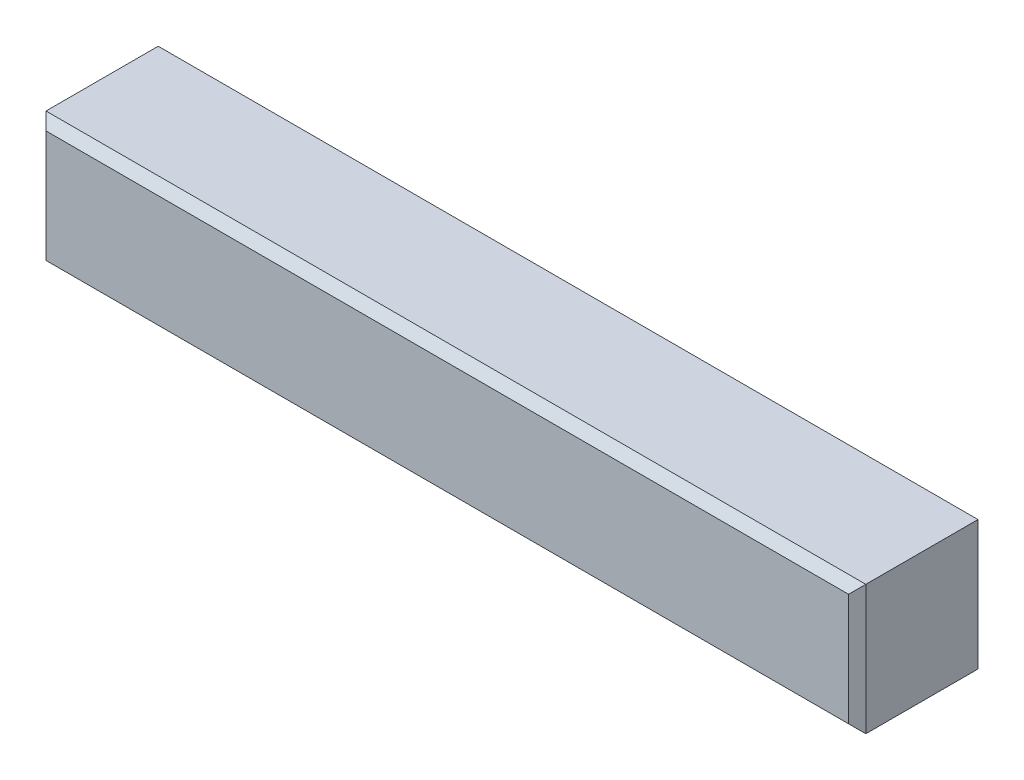
ISO-10303-21;
HEADER;
FILE_DESCRIPTION(('STEP AP214'),'2;1');
FILE_NAME('part.step','',(''),(''),'','','');
FILE_SCHEMA(('AUTOMOTIVE_DESIGN { 1 0 10303 214 1 1 1 1 }'));
ENDSEC;
DATA;
#1=APPLICATION_CONTEXT('core data for automotive mechanical design processes');
#2=APPLICATION_PROTOCOL_DEFINITION('international standard','automotive_design',2000,#1);
#3=PRODUCT_CONTEXT('',#1,'mechanical');
#4=PRODUCT('Part','Part','',(#3));
#5=PRODUCT_RELATED_PRODUCT_CATEGORY('part','',(#4));
#6=PRODUCT_DEFINITION_FORMATION('','',#4);
#7=PRODUCT_DEFINITION_CONTEXT('part definition',#1,'design');
#8=PRODUCT_DEFINITION('design','',#6,#7);
#9=PRODUCT_DEFINITION_SHAPE('','',#8);
#10=(LENGTH_UNIT() NAMED_UNIT(*) SI_UNIT(.MILLI.,.METRE.));
#11=(NAMED_UNIT(*) PLANE_ANGLE_UNIT() SI_UNIT($,.RADIAN.));
#12=(NAMED_UNIT(*) SI_UNIT($,.STERADIAN.) SOLID_ANGLE_UNIT());
#13=UNCERTAINTY_MEASURE_WITH_UNIT(LENGTH_MEASURE(1.E-05),#10,'distance_accuracy_value','');
#14=(GEOMETRIC_REPRESENTATION_CONTEXT(3) GLOBAL_UNCERTAINTY_ASSIGNED_CONTEXT((#13)) GLOBAL_UNIT_ASSIGNED_CONTEXT((#10,
#11,#12)) REPRESENTATION_CONTEXT('',''));
#15=CARTESIAN_POINT('',(0.,0.,0.));
#16=DIRECTION('',(0.,0.,1.));
#17=DIRECTION('',(1.,0.,0.));
#18=AXIS2_PLACEMENT_3D('',#15,#16,#17);
#19=CARTESIAN_POINT('',(38.,-2.60000000000004,6.0000000000001));
#20=DIRECTION('',(0.,0.707106781186554,-0.707106781186553));
#21=DIRECTION('',(0.,0.707106781186553,0.707106781186554));
#22=AXIS2_PLACEMENT_3D('',#19,#20,#21);
#23=PLANE('',#22);
#24=DIRECTION('',(0.577350269189626,0.577350269189632,0.577350269189632));
#25=VECTOR('',#24,1.);
#26=CARTESIAN_POINT('',(12.9333333333333,9.93333333333334,18.5333333333334));
#27=LINE('',#26,#25);
#28=CARTESIAN_POINT('',(0.,-3.00000000000005,5.6));
#29=VERTEX_POINT('',#28);
#30=CARTESIAN_POINT('',(0.400000000000011,-2.60000000000004,6.0000000000001));
#31=VERTEX_POINT('',#30);
#32=EDGE_CURVE('E82',#29,#31,#27,.T.);
#33=ORIENTED_EDGE('',*,*,#32,.F.);
#34=DIRECTION('',(-1.,0.,0.));
#35=VECTOR('',#34,1.);
#36=CARTESIAN_POINT('',(38.,-3.00000000000005,5.60000000000001));
#37=LINE('',#36,#35);
#38=CARTESIAN_POINT('',(38.,-3.00000000000005,5.60000000000001));
#39=VERTEX_POINT('',#38);
#40=EDGE_CURVE('E95',#39,#29,#37,.T.);
#41=ORIENTED_EDGE('',*,*,#40,.F.);
#42=DIRECTION('',(0.577350269189623,-0.577350269189633,-0.577350269189633));
#43=VECTOR('',#42,1.);
#44=CARTESIAN_POINT('',(37.7333333333333,-2.73333333333338,5.86666666666677));
#45=LINE('',#44,#43);
#46=CARTESIAN_POINT('',(37.6,-2.60000000000004,6.0000000000001));
#47=VERTEX_POINT('',#46);
#48=EDGE_CURVE('E172',#47,#39,#45,.T.);
#49=ORIENTED_EDGE('',*,*,#48,.F.);
#50=DIRECTION('',(-1.,0.,0.));
#51=VECTOR('',#50,1.);
#52=CARTESIAN_POINT('',(38.,-2.60000000000004,6.0000000000001));
#53=LINE('',#52,#51);
#54=EDGE_CURVE('E98',#47,#31,#53,.T.);
#55=ORIENTED_EDGE('',*,*,#54,.T.);
#56=EDGE_LOOP('',(#33,#41,#49,#55));
#57=FACE_BOUND('',#56,.T.);
#58=ADVANCED_FACE('F16',(#57),#23,.F.);
#59=CARTESIAN_POINT('',(38.,2.59999999999999,6.00000000000001));
#60=DIRECTION('',(0.,0.,-1.00000000000001));
#61=DIRECTION('',(-1.,0.,0.));
#62=AXIS2_PLACEMENT_3D('',#59,#60,#61);
#63=PLANE('',#62);
#64=DIRECTION('',(0.,1.00000000000001,0.));
#65=VECTOR('',#64,1.);
#66=CARTESIAN_POINT('',(0.400000000000011,2.6,6.0000000000001));
#67=LINE('',#66,#65);
#68=CARTESIAN_POINT('',(0.400000000000011,2.6,6.0000000000001));
#69=VERTEX_POINT('',#68);
#70=EDGE_CURVE('E101',#31,#69,#67,.T.);
#71=ORIENTED_EDGE('',*,*,#70,.F.);
#72=ORIENTED_EDGE('',*,*,#54,.F.);
#73=DIRECTION('',(0.,-1.00000000000001,0.));
#74=VECTOR('',#73,1.);
#75=CARTESIAN_POINT('',(37.6,2.6,6.00000000000001));
#76=LINE('',#75,#74);
#77=CARTESIAN_POINT('',(37.6,2.6,6.00000000000001));
#78=VERTEX_POINT('',#77);
#79=EDGE_CURVE('E100',#78,#47,#76,.T.);
#80=ORIENTED_EDGE('',*,*,#79,.F.);
#81=DIRECTION('',(-1.,0.,0.));
#82=VECTOR('',#81,1.);
#83=CARTESIAN_POINT('',(38.,2.59999999999999,6.00000000000001));
#84=LINE('',#83,#82);
#85=EDGE_CURVE('E142',#78,#69,#84,.T.);
#86=ORIENTED_EDGE('',*,*,#85,.T.);
#87=EDGE_LOOP('',(#71,#72,#80,#86));
#88=FACE_BOUND('',#87,.T.);
#89=ADVANCED_FACE('F170',(#88),#63,.F.);
#90=CARTESIAN_POINT('',(38.,3.00000000000002,5.60000000000009));
#91=DIRECTION('',(0.,-0.707106781186554,-0.707106781186554));
#92=DIRECTION('',(0.,0.707106781186554,-0.707106781186554));
#93=AXIS2_PLACEMENT_3D('',#90,#91,#92);
#94=PLANE('',#93);
#95=DIRECTION('',(-0.577350269189626,0.577350269189632,-0.577350269189632));
#96=VECTOR('',#95,1.);
#97=CARTESIAN_POINT('',(12.6666666666667,-9.66666666666676,18.2666666666668));
#98=LINE('',#97,#96);
#99=CARTESIAN_POINT('',(0.,3.00000000000002,5.60000000000009));
#100=VERTEX_POINT('',#99);
#101=EDGE_CURVE('E85',#69,#100,#98,.T.);
#102=ORIENTED_EDGE('',*,*,#101,.F.);
#103=ORIENTED_EDGE('',*,*,#85,.F.);
#104=DIRECTION('',(-0.577350269189623,-0.577350269189633,0.577350269189633));
#105=VECTOR('',#104,1.);
#106=CARTESIAN_POINT('',(38.,3.00000000000002,5.60000000000009));
#107=LINE('',#106,#105);
#108=CARTESIAN_POINT('',(38.,3.00000000000002,5.60000000000009));
#109=VERTEX_POINT('',#108);
#110=EDGE_CURVE('E25',#109,#78,#107,.T.);
#111=ORIENTED_EDGE('',*,*,#110,.F.);
#112=DIRECTION('',(-1.,0.,0.));
#113=VECTOR('',#112,1.);
#114=CARTESIAN_POINT('',(38.,3.00000000000002,5.60000000000009));
#115=LINE('',#114,#113);
#116=EDGE_CURVE('E146',#109,#100,#115,.T.);
#117=ORIENTED_EDGE('',*,*,#116,.T.);
#118=EDGE_LOOP('',(#102,#103,#111,#117));
#119=FACE_BOUND('',#118,.T.);
#120=ADVANCED_FACE('F174',(#119),#94,.F.);
#121=CARTESIAN_POINT('',(0.,-5.60000000000009,2.99999999999999));
#122=DIRECTION('',(1.,0.,0.));
#123=DIRECTION('',(0.,1.00000000000001,0.));
#124=AXIS2_PLACEMENT_3D('',#121,#122,#123);
#125=PLANE('',#124);
#126=DIRECTION('',(0.,-1.00000000000001,0.));
#127=VECTOR('',#126,1.);
#128=CARTESIAN_POINT('',(0.,-5.60000000000005,5.59999999999999));
#129=LINE('',#128,#127);
#130=EDGE_CURVE('E11',#100,#29,#129,.T.);
#131=ORIENTED_EDGE('',*,*,#130,.F.);
#132=DIRECTION('',(0.,0.,1.00000000000001));
#133=VECTOR('',#132,1.);
#134=CARTESIAN_POINT('',(0.,3.,0.400000000000095));
#135=LINE('',#134,#133);
#136=CARTESIAN_POINT('',(0.,3.,0.400000000000095));
#137=VERTEX_POINT('',#136);
#138=EDGE_CURVE('E118',#137,#100,#135,.T.);
#139=ORIENTED_EDGE('',*,*,#138,.F.);
#140=DIRECTION('',(0.,-1.00000000000001,0.));
#141=VECTOR('',#140,1.);
#142=CARTESIAN_POINT('',(0.,-5.6000000000001,0.399999999999998));
#143=LINE('',#142,#141);
#144=CARTESIAN_POINT('',(0.,-3.0000000000001,0.399999999999991));
#145=VERTEX_POINT('',#144);
#146=EDGE_CURVE('E115',#137,#145,#143,.T.);
#147=ORIENTED_EDGE('',*,*,#146,.T.);
#148=DIRECTION('',(0.,0.,-1.00000000000001));
#149=VECTOR('',#148,1.);
#150=CARTESIAN_POINT('',(0.,-3.00000000000005,5.6));
#151=LINE('',#150,#149);
#152=EDGE_CURVE('E107',#29,#145,#151,.T.);
#153=ORIENTED_EDGE('',*,*,#152,.F.);
#154=EDGE_LOOP('',(#131,#139,#147,#153));
#155=FACE_BOUND('',#154,.T.);
#156=ADVANCED_FACE('F114',(#155),#125,.F.);
#157=CARTESIAN_POINT('',(38.,-5.60000000000014,3.));
#158=DIRECTION('',(1.,0.,0.));
#159=DIRECTION('',(0.,1.00000000000001,0.));
#160=AXIS2_PLACEMENT_3D('',#157,#158,#159);
#161=PLANE('',#160);
#162=DIRECTION('',(0.,0.,1.00000000000001));
#163=VECTOR('',#162,1.);
#164=CARTESIAN_POINT('',(38.,3.,0.400000000000095));
#165=LINE('',#164,#163);
#166=CARTESIAN_POINT('',(38.,3.,0.400000000000095));
#167=VERTEX_POINT('',#166);
#168=EDGE_CURVE('E131',#167,#109,#165,.T.);
#169=ORIENTED_EDGE('',*,*,#168,.T.);
#170=DIRECTION('',(0.,-1.00000000000001,0.));
#171=VECTOR('',#170,1.);
#172=CARTESIAN_POINT('',(38.,-5.60000000000005,5.59999999999999));
#173=LINE('',#172,#171);
#174=EDGE_CURVE('E32',#109,#39,#173,.T.);
#175=ORIENTED_EDGE('',*,*,#174,.T.);
#176=DIRECTION('',(0.,0.,-1.00000000000001));
#177=VECTOR('',#176,1.);
#178=CARTESIAN_POINT('',(38.,-3.00000000000005,5.60000000000001));
#179=LINE('',#178,#177);
#180=CARTESIAN_POINT('',(38.,-3.0000000000001,0.399999999999991));
#181=VERTEX_POINT('',#180);
#182=EDGE_CURVE('E109',#39,#181,#179,.T.);
#183=ORIENTED_EDGE('',*,*,#182,.T.);
#184=DIRECTION('',(0.,1.00000000000001,0.));
#185=VECTOR('',#184,1.);
#186=CARTESIAN_POINT('',(38.,-5.6000000000001,0.399999999999998));
#187=LINE('',#186,#185);
#188=EDGE_CURVE('E160',#181,#167,#187,.T.);
#189=ORIENTED_EDGE('',*,*,#188,.T.);
#190=EDGE_LOOP('',(#169,#175,#183,#189));
#191=FACE_BOUND('',#190,.T.);
#192=ADVANCED_FACE('F208',(#191),#161,.T.);
#193=CARTESIAN_POINT('',(38.,-2.60000000000005,0.));
#194=DIRECTION('',(0.,-0.707106781186554,-0.707106781186554));
#195=DIRECTION('',(0.,0.707106781186554,-0.707106781186554));
#196=AXIS2_PLACEMENT_3D('',#193,#194,#195);
#197=PLANE('',#196);
#198=DIRECTION('',(-1.,0.,0.));
#199=VECTOR('',#198,1.);
#200=CARTESIAN_POINT('',(38.,-2.60000000000005,0.));
#201=LINE('',#200,#199);
#202=CARTESIAN_POINT('',(37.6,-2.60000000000005,0.));
#203=VERTEX_POINT('',#202);
#204=CARTESIAN_POINT('',(0.400000000000011,-2.60000000000005,0.));
#205=VERTEX_POINT('',#204);
#206=EDGE_CURVE('E135',#203,#205,#201,.T.);
#207=ORIENTED_EDGE('',*,*,#206,.F.);
#208=DIRECTION('',(0.577350269189623,-0.577350269189633,0.577350269189633));
#209=VECTOR('',#208,1.);
#210=CARTESIAN_POINT('',(37.7333333333333,-2.73333333333343,0.13333333333343));
#211=LINE('',#210,#209);
#212=EDGE_CURVE('E187',#203,#181,#211,.T.);
#213=ORIENTED_EDGE('',*,*,#212,.T.);
#214=DIRECTION('',(-1.,0.,0.));
#215=VECTOR('',#214,1.);
#216=CARTESIAN_POINT('',(38.,-3.0000000000001,0.399999999999991));
#217=LINE('',#216,#215);
#218=EDGE_CURVE('E111',#181,#145,#217,.T.);
#219=ORIENTED_EDGE('',*,*,#218,.T.);
#220=DIRECTION('',(-0.577350269189626,-0.577350269189632,0.577350269189632));
#221=VECTOR('',#220,1.);
#222=CARTESIAN_POINT('',(12.9333333333333,9.93333333333334,-12.5333333333336));
#223=LINE('',#222,#221);
#224=EDGE_CURVE('E128',#205,#145,#223,.T.);
#225=ORIENTED_EDGE('',*,*,#224,.F.);
#226=EDGE_LOOP('',(#207,#213,#219,#225));
#227=FACE_BOUND('',#226,.T.);
#228=ADVANCED_FACE('F18',(#227),#197,.T.);
#229=CARTESIAN_POINT('',(38.,2.6,0.));
#230=DIRECTION('',(0.,-0.707106781186553,0.707106781186554));
#231=DIRECTION('',(0.,-0.707106781186554,-0.707106781186553));
#232=AXIS2_PLACEMENT_3D('',#229,#230,#231);
#233=PLANE('',#232);
#234=DIRECTION('',(0.577350269189623,0.577350269189633,0.577350269189633));
#235=VECTOR('',#234,1.);
#236=CARTESIAN_POINT('',(37.7333333333333,2.73333333333333,0.133333333333333));
#237=LINE('',#236,#235);
#238=CARTESIAN_POINT('',(37.6,2.6,0.));
#239=VERTEX_POINT('',#238);
#240=EDGE_CURVE('E40',#239,#167,#237,.T.);
#241=ORIENTED_EDGE('',*,*,#240,.F.);
#242=DIRECTION('',(-1.,0.,0.));
#243=VECTOR('',#242,1.);
#244=CARTESIAN_POINT('',(38.,2.6,0.));
#245=LINE('',#244,#243);
#246=CARTESIAN_POINT('',(0.400000000000011,2.6,0.));
#247=VERTEX_POINT('',#246);
#248=EDGE_CURVE('E153',#239,#247,#245,.T.);
#249=ORIENTED_EDGE('',*,*,#248,.T.);
#250=DIRECTION('',(-0.577350269189626,0.577350269189632,0.577350269189632));
#251=VECTOR('',#250,1.);
#252=CARTESIAN_POINT('',(12.9333333333333,-9.93333333333353,-12.5333333333336));
#253=LINE('',#252,#251);
#254=EDGE_CURVE('E194',#247,#137,#253,.T.);
#255=ORIENTED_EDGE('',*,*,#254,.T.);
#256=DIRECTION('',(-1.,0.,0.));
#257=VECTOR('',#256,1.);
#258=CARTESIAN_POINT('',(38.,3.,0.400000000000095));
#259=LINE('',#258,#257);
#260=EDGE_CURVE('E149',#167,#137,#259,.T.);
#261=ORIENTED_EDGE('',*,*,#260,.F.);
#262=EDGE_LOOP('',(#241,#249,#255,#261));
#263=FACE_BOUND('',#262,.T.);
#264=ADVANCED_FACE('F214',(#263),#233,.F.);
#265=CARTESIAN_POINT('',(38.,-2.60000000000005,0.));
#266=DIRECTION('',(0.,0.,1.00000000000001));
#267=DIRECTION('',(1.,0.,0.));
#268=AXIS2_PLACEMENT_3D('',#265,#266,#267);
#269=PLANE('',#268);
#270=DIRECTION('',(0.,1.00000000000001,0.));
#271=VECTOR('',#270,1.);
#272=CARTESIAN_POINT('',(37.6,-2.60000000000005,0.));
#273=LINE('',#272,#271);
#274=EDGE_CURVE('E191',#203,#239,#273,.T.);
#275=ORIENTED_EDGE('',*,*,#274,.F.);
#276=ORIENTED_EDGE('',*,*,#206,.T.);
#277=DIRECTION('',(0.,1.00000000000001,0.));
#278=VECTOR('',#277,1.);
#279=CARTESIAN_POINT('',(0.400000000000011,-2.60000000000005,0.));
#280=LINE('',#279,#278);
#281=EDGE_CURVE('E119',#205,#247,#280,.T.);
#282=ORIENTED_EDGE('',*,*,#281,.T.);
#283=ORIENTED_EDGE('',*,*,#248,.F.);
#284=EDGE_LOOP('',(#275,#276,#282,#283));
#285=FACE_BOUND('',#284,.T.);
#286=ADVANCED_FACE('F218',(#285),#269,.F.);
#287=CARTESIAN_POINT('',(38.,-3.00000000000005,5.60000000000001));
#288=DIRECTION('',(0.,1.00000000000001,0.));
#289=DIRECTION('',(-1.,0.,0.));
#290=AXIS2_PLACEMENT_3D('',#287,#288,#289);
#291=PLANE('',#290);
#292=ORIENTED_EDGE('',*,*,#152,.T.);
#293=ORIENTED_EDGE('',*,*,#218,.F.);
#294=ORIENTED_EDGE('',*,*,#182,.F.);
#295=ORIENTED_EDGE('',*,*,#40,.T.);
#296=EDGE_LOOP('',(#292,#293,#294,#295));
#297=FACE_BOUND('',#296,.T.);
#298=ADVANCED_FACE('F105',(#297),#291,.F.);
#299=CARTESIAN_POINT('',(38.,3.,0.400000000000095));
#300=DIRECTION('',(0.,-1.00000000000001,0.));
#301=DIRECTION('',(1.,0.,0.));
#302=AXIS2_PLACEMENT_3D('',#299,#300,#301);
#303=PLANE('',#302);
#304=ORIENTED_EDGE('',*,*,#138,.T.);
#305=ORIENTED_EDGE('',*,*,#116,.F.);
#306=ORIENTED_EDGE('',*,*,#168,.F.);
#307=ORIENTED_EDGE('',*,*,#260,.T.);
#308=EDGE_LOOP('',(#304,#305,#306,#307));
#309=FACE_BOUND('',#308,.T.);
#310=ADVANCED_FACE('F212',(#309),#303,.F.);
#311=CARTESIAN_POINT('',(0.439999999999996,3.,-0.0399999999999012));
#312=DIRECTION('',(0.707106781186548,0.,0.707106781186554));
#313=DIRECTION('',(-0.707106781186548,0.,0.707106781186554));
#314=AXIS2_PLACEMENT_3D('',#311,#312,#313);
#315=PLANE('',#314);
#316=ORIENTED_EDGE('',*,*,#224,.T.);
#317=ORIENTED_EDGE('',*,*,#146,.F.);
#318=ORIENTED_EDGE('',*,*,#254,.F.);
#319=ORIENTED_EDGE('',*,*,#281,.F.);
#320=EDGE_LOOP('',(#316,#317,#318,#319));
#321=FACE_BOUND('',#320,.T.);
#322=ADVANCED_FACE('F203',(#321),#315,.F.);
#323=CARTESIAN_POINT('',(37.56,3.,-0.0399999999999012));
#324=DIRECTION('',(0.70710678118655,0.,-0.707106781186551));
#325=DIRECTION('',(0.707106781186545,0.,0.707106781186556));
#326=AXIS2_PLACEMENT_3D('',#323,#324,#325);
#327=PLANE('',#326);
#328=ORIENTED_EDGE('',*,*,#274,.T.);
#329=ORIENTED_EDGE('',*,*,#240,.T.);
#330=ORIENTED_EDGE('',*,*,#188,.F.);
#331=ORIENTED_EDGE('',*,*,#212,.F.);
#332=EDGE_LOOP('',(#328,#329,#330,#331));
#333=FACE_BOUND('',#332,.T.);
#334=ADVANCED_FACE('F219',(#333),#327,.T.);
#335=CARTESIAN_POINT('',(38.04,3.00000000000002,5.56000000000009));
#336=DIRECTION('',(0.70710678118655,0.,0.707106781186551));
#337=DIRECTION('',(-0.707106781186545,0.,0.707106781186556));
#338=AXIS2_PLACEMENT_3D('',#335,#336,#337);
#339=PLANE('',#338);
#340=ORIENTED_EDGE('',*,*,#110,.T.);
#341=ORIENTED_EDGE('',*,*,#79,.T.);
#342=ORIENTED_EDGE('',*,*,#48,.T.);
#343=ORIENTED_EDGE('',*,*,#174,.F.);
#344=EDGE_LOOP('',(#340,#341,#342,#343));
#345=FACE_BOUND('',#344,.T.);
#346=ADVANCED_FACE('F165',(#345),#339,.T.);
#347=CARTESIAN_POINT('',(0.439999999999996,2.99999999999999,6.04000000000014));
#348=DIRECTION('',(-0.707106781186548,0.,0.707106781186553));
#349=DIRECTION('',(-0.707106781186547,0.,-0.707106781186554));
#350=AXIS2_PLACEMENT_3D('',#347,#348,#349);
#351=PLANE('',#350);
#352=ORIENTED_EDGE('',*,*,#32,.T.);
#353=ORIENTED_EDGE('',*,*,#70,.T.);
#354=ORIENTED_EDGE('',*,*,#101,.T.);
#355=ORIENTED_EDGE('',*,*,#130,.T.);
#356=EDGE_LOOP('',(#352,#353,#354,#355));
#357=FACE_BOUND('',#356,.T.);
#358=ADVANCED_FACE('F81',(#357),#351,.T.);
#359=CLOSED_SHELL('',(#58,#89,#120,#156,#192,#228,#264,#286,#298,#310,#322,#334,#346,#358));
#360=MANIFOLD_SOLID_BREP('B1',#359);
#361=ADVANCED_BREP_SHAPE_REPRESENTATION('',(#18,#360),#14);
#362=SHAPE_DEFINITION_REPRESENTATION(#9,#361);
ENDSEC;
END-ISO-10303-21;
